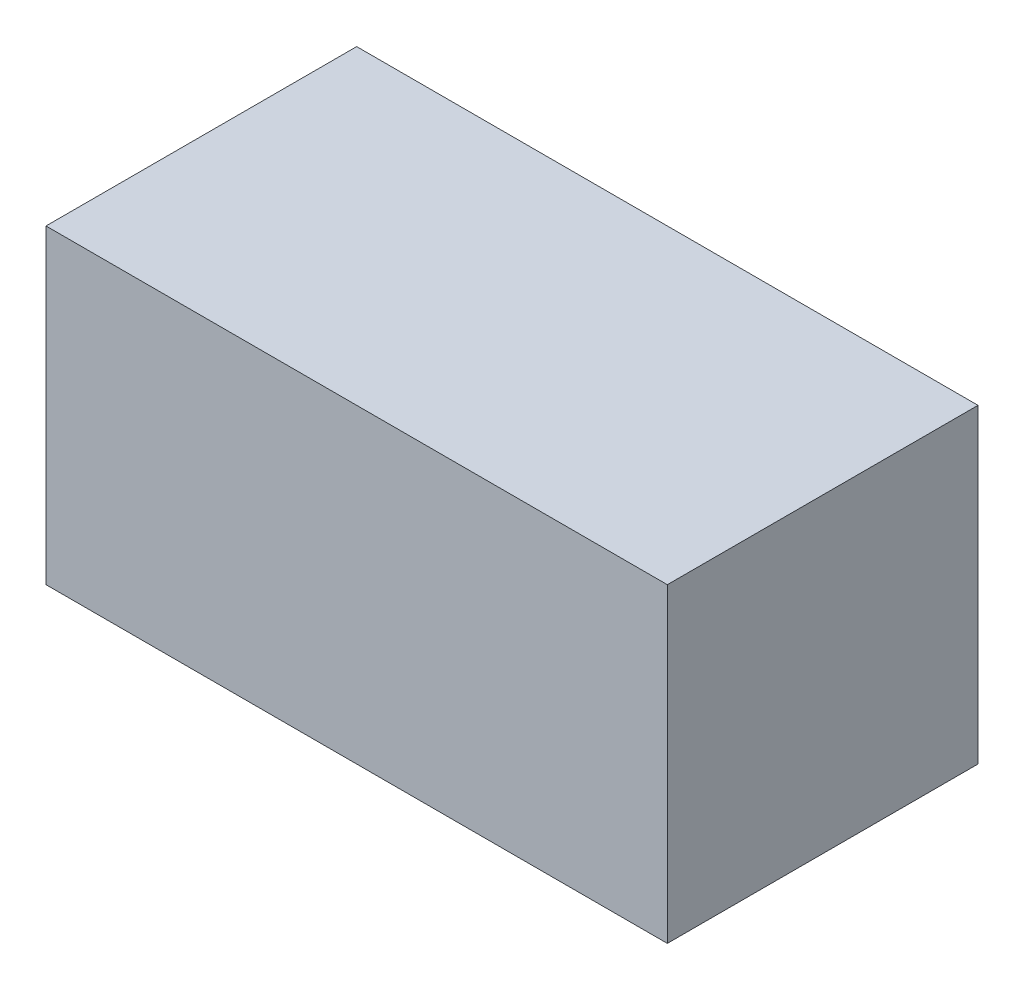
ISO-10303-21;
HEADER;
FILE_DESCRIPTION(('STEP AP214'),'2;1');
FILE_NAME('part.step','',(''),(''),'','','');
FILE_SCHEMA(('AUTOMOTIVE_DESIGN { 1 0 10303 214 1 1 1 1 }'));
ENDSEC;
DATA;
#1=APPLICATION_CONTEXT('core data for automotive mechanical design processes');
#2=APPLICATION_PROTOCOL_DEFINITION('international standard','automotive_design',2000,#1);
#3=PRODUCT_CONTEXT('',#1,'mechanical');
#4=PRODUCT('Part','Part','',(#3));
#5=PRODUCT_RELATED_PRODUCT_CATEGORY('part','',(#4));
#6=PRODUCT_DEFINITION_FORMATION('','',#4);
#7=PRODUCT_DEFINITION_CONTEXT('part definition',#1,'design');
#8=PRODUCT_DEFINITION('design','',#6,#7);
#9=PRODUCT_DEFINITION_SHAPE('','',#8);
#10=(LENGTH_UNIT() NAMED_UNIT(*) SI_UNIT(.MILLI.,.METRE.));
#11=(NAMED_UNIT(*) PLANE_ANGLE_UNIT() SI_UNIT($,.RADIAN.));
#12=(NAMED_UNIT(*) SI_UNIT($,.STERADIAN.) SOLID_ANGLE_UNIT());
#13=UNCERTAINTY_MEASURE_WITH_UNIT(LENGTH_MEASURE(1.E-05),#10,'distance_accuracy_value','');
#14=(GEOMETRIC_REPRESENTATION_CONTEXT(3) GLOBAL_UNCERTAINTY_ASSIGNED_CONTEXT((#13)) GLOBAL_UNIT_ASSIGNED_CONTEXT((#10,
#11,#12)) REPRESENTATION_CONTEXT('',''));
#15=CARTESIAN_POINT('',(0.,0.,0.));
#16=DIRECTION('',(0.,0.,1.));
#17=DIRECTION('',(1.,0.,0.));
#18=AXIS2_PLACEMENT_3D('',#15,#16,#17);
#19=CARTESIAN_POINT('',(0.,10.,0.));
#20=DIRECTION('',(1.,0.,0.));
#21=DIRECTION('',(0.,0.,-1.));
#22=AXIS2_PLACEMENT_3D('',#19,#20,#21);
#23=PLANE('',#22);
#24=DIRECTION('',(0.,0.,1.));
#25=VECTOR('',#24,1.);
#26=CARTESIAN_POINT('',(0.,0.,0.));
#27=LINE('',#26,#25);
#28=CARTESIAN_POINT('',(0.,0.,-10.));
#29=VERTEX_POINT('',#28);
#30=CARTESIAN_POINT('',(0.,0.,0.));
#31=VERTEX_POINT('',#30);
#32=EDGE_CURVE('E74',#29,#31,#27,.T.);
#33=ORIENTED_EDGE('',*,*,#32,.T.);
#34=DIRECTION('',(0.,-1.,0.));
#35=VECTOR('',#34,1.);
#36=CARTESIAN_POINT('',(0.,10.,0.));
#37=LINE('',#36,#35);
#38=CARTESIAN_POINT('',(0.,10.,0.));
#39=VERTEX_POINT('',#38);
#40=EDGE_CURVE('E11',#39,#31,#37,.T.);
#41=ORIENTED_EDGE('',*,*,#40,.F.);
#42=DIRECTION('',(0.,0.,1.));
#43=VECTOR('',#42,1.);
#44=CARTESIAN_POINT('',(0.,10.,0.));
#45=LINE('',#44,#43);
#46=CARTESIAN_POINT('',(0.,10.,-10.));
#47=VERTEX_POINT('',#46);
#48=EDGE_CURVE('E92',#47,#39,#45,.T.);
#49=ORIENTED_EDGE('',*,*,#48,.F.);
#50=DIRECTION('',(0.,-1.,0.));
#51=VECTOR('',#50,1.);
#52=CARTESIAN_POINT('',(0.,10.,-10.));
#53=LINE('',#52,#51);
#54=EDGE_CURVE('E86',#47,#29,#53,.T.);
#55=ORIENTED_EDGE('',*,*,#54,.T.);
#56=EDGE_LOOP('',(#33,#41,#49,#55));
#57=FACE_BOUND('',#56,.T.);
#58=ADVANCED_FACE('F30',(#57),#23,.F.);
#59=CARTESIAN_POINT('',(0.,10.,0.));
#60=DIRECTION('',(0.,0.,-1.));
#61=DIRECTION('',(-1.,0.,0.));
#62=AXIS2_PLACEMENT_3D('',#59,#60,#61);
#63=PLANE('',#62);
#64=DIRECTION('',(1.,0.,0.));
#65=VECTOR('',#64,1.);
#66=CARTESIAN_POINT('',(0.,0.,0.));
#67=LINE('',#66,#65);
#68=CARTESIAN_POINT('',(20.,0.,0.));
#69=VERTEX_POINT('',#68);
#70=EDGE_CURVE('E70',#31,#69,#67,.T.);
#71=ORIENTED_EDGE('',*,*,#70,.T.);
#72=DIRECTION('',(0.,-1.,0.));
#73=VECTOR('',#72,1.);
#74=CARTESIAN_POINT('',(20.,10.,0.));
#75=LINE('',#74,#73);
#76=CARTESIAN_POINT('',(20.,10.,0.));
#77=VERTEX_POINT('',#76);
#78=EDGE_CURVE('E37',#77,#69,#75,.T.);
#79=ORIENTED_EDGE('',*,*,#78,.F.);
#80=DIRECTION('',(1.,0.,0.));
#81=VECTOR('',#80,1.);
#82=CARTESIAN_POINT('',(0.,10.,0.));
#83=LINE('',#82,#81);
#84=EDGE_CURVE('E82',#39,#77,#83,.T.);
#85=ORIENTED_EDGE('',*,*,#84,.F.);
#86=ORIENTED_EDGE('',*,*,#40,.T.);
#87=EDGE_LOOP('',(#71,#79,#85,#86));
#88=FACE_BOUND('',#87,.T.);
#89=ADVANCED_FACE('F81',(#88),#63,.F.);
#90=CARTESIAN_POINT('',(20.,10.,0.));
#91=DIRECTION('',(-1.,0.,0.));
#92=DIRECTION('',(0.,0.,1.));
#93=AXIS2_PLACEMENT_3D('',#90,#91,#92);
#94=PLANE('',#93);
#95=DIRECTION('',(0.,0.,-1.));
#96=VECTOR('',#95,1.);
#97=CARTESIAN_POINT('',(20.,0.,0.));
#98=LINE('',#97,#96);
#99=CARTESIAN_POINT('',(20.,0.,-10.));
#100=VERTEX_POINT('',#99);
#101=EDGE_CURVE('E75',#69,#100,#98,.T.);
#102=ORIENTED_EDGE('',*,*,#101,.T.);
#103=DIRECTION('',(0.,-1.,0.));
#104=VECTOR('',#103,1.);
#105=CARTESIAN_POINT('',(20.,10.,-10.));
#106=LINE('',#105,#104);
#107=CARTESIAN_POINT('',(20.,10.,-10.));
#108=VERTEX_POINT('',#107);
#109=EDGE_CURVE('E98',#108,#100,#106,.T.);
#110=ORIENTED_EDGE('',*,*,#109,.F.);
#111=DIRECTION('',(0.,0.,-1.));
#112=VECTOR('',#111,1.);
#113=CARTESIAN_POINT('',(20.,10.,0.));
#114=LINE('',#113,#112);
#115=EDGE_CURVE('E49',#77,#108,#114,.T.);
#116=ORIENTED_EDGE('',*,*,#115,.F.);
#117=ORIENTED_EDGE('',*,*,#78,.T.);
#118=EDGE_LOOP('',(#102,#110,#116,#117));
#119=FACE_BOUND('',#118,.T.);
#120=ADVANCED_FACE('F101',(#119),#94,.F.);
#121=CARTESIAN_POINT('',(0.,10.,-10.));
#122=DIRECTION('',(0.,0.,1.));
#123=DIRECTION('',(1.,0.,0.));
#124=AXIS2_PLACEMENT_3D('',#121,#122,#123);
#125=PLANE('',#124);
#126=DIRECTION('',(-1.,0.,0.));
#127=VECTOR('',#126,1.);
#128=CARTESIAN_POINT('',(0.,0.,-10.));
#129=LINE('',#128,#127);
#130=EDGE_CURVE('E90',#100,#29,#129,.T.);
#131=ORIENTED_EDGE('',*,*,#130,.T.);
#132=ORIENTED_EDGE('',*,*,#54,.F.);
#133=DIRECTION('',(-1.,0.,0.));
#134=VECTOR('',#133,1.);
#135=CARTESIAN_POINT('',(0.,10.,-10.));
#136=LINE('',#135,#134);
#137=EDGE_CURVE('E44',#108,#47,#136,.T.);
#138=ORIENTED_EDGE('',*,*,#137,.F.);
#139=ORIENTED_EDGE('',*,*,#109,.T.);
#140=EDGE_LOOP('',(#131,#132,#138,#139));
#141=FACE_BOUND('',#140,.T.);
#142=ADVANCED_FACE('F103',(#141),#125,.F.);
#143=CARTESIAN_POINT('',(0.,10.,-10.));
#144=DIRECTION('',(0.,-1.,0.));
#145=DIRECTION('',(0.,0.,-1.));
#146=AXIS2_PLACEMENT_3D('',#143,#144,#145);
#147=PLANE('',#146);
#148=ORIENTED_EDGE('',*,*,#48,.T.);
#149=ORIENTED_EDGE('',*,*,#84,.T.);
#150=ORIENTED_EDGE('',*,*,#115,.T.);
#151=ORIENTED_EDGE('',*,*,#137,.T.);
#152=EDGE_LOOP('',(#148,#149,#150,#151));
#153=FACE_BOUND('',#152,.T.);
#154=ADVANCED_FACE('F104',(#153),#147,.F.);
#155=CARTESIAN_POINT('',(0.,0.,-10.));
#156=DIRECTION('',(0.,-1.,0.));
#157=DIRECTION('',(0.,0.,-1.));
#158=AXIS2_PLACEMENT_3D('',#155,#156,#157);
#159=PLANE('',#158);
#160=ORIENTED_EDGE('',*,*,#32,.F.);
#161=ORIENTED_EDGE('',*,*,#130,.F.);
#162=ORIENTED_EDGE('',*,*,#101,.F.);
#163=ORIENTED_EDGE('',*,*,#70,.F.);
#164=EDGE_LOOP('',(#160,#161,#162,#163));
#165=FACE_BOUND('',#164,.T.);
#166=ADVANCED_FACE('F71',(#165),#159,.T.);
#167=CLOSED_SHELL('',(#58,#89,#120,#142,#154,#166));
#168=MANIFOLD_SOLID_BREP('B2',#167);
#169=ADVANCED_BREP_SHAPE_REPRESENTATION('',(#18,#168),#14);
#170=SHAPE_DEFINITION_REPRESENTATION(#9,#169);
ENDSEC;
END-ISO-10303-21;
